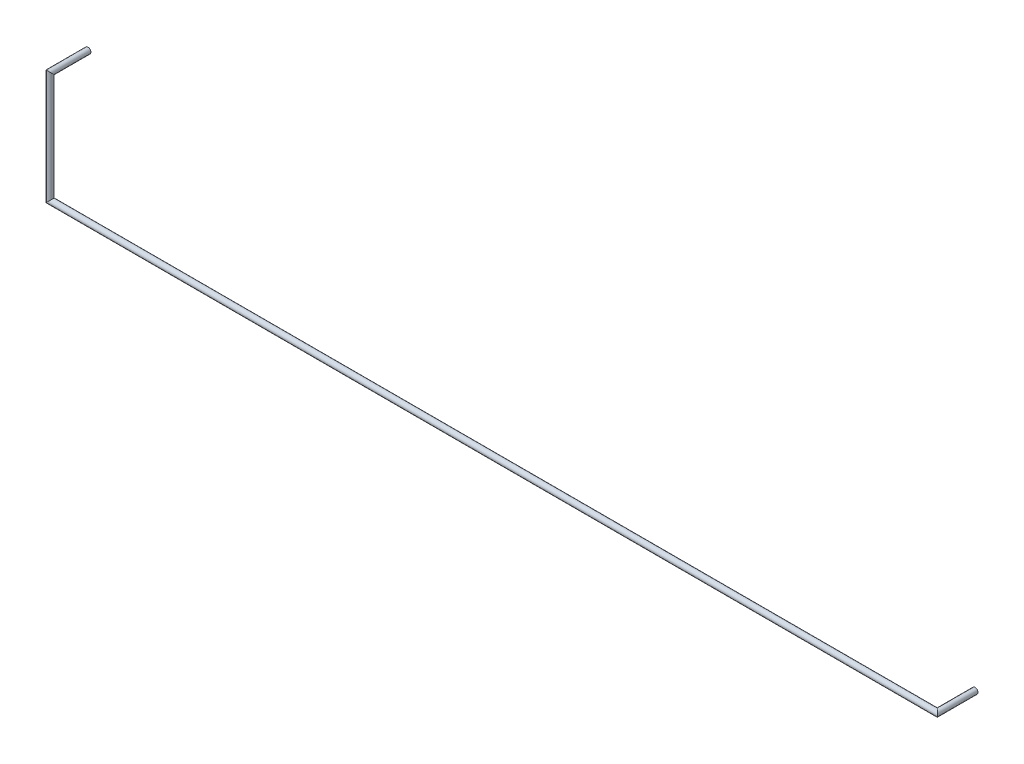
ISO-10303-21;
HEADER;
FILE_DESCRIPTION(('STEP AP214'),'2;1');
FILE_NAME('part.step','',(''),(''),'','','');
FILE_SCHEMA(('AUTOMOTIVE_DESIGN { 1 0 10303 214 1 1 1 1 }'));
ENDSEC;
DATA;
#1=APPLICATION_CONTEXT('core data for automotive mechanical design processes');
#2=APPLICATION_PROTOCOL_DEFINITION('international standard','automotive_design',2000,#1);
#3=PRODUCT_CONTEXT('',#1,'mechanical');
#4=PRODUCT('Part','Part','',(#3));
#5=PRODUCT_RELATED_PRODUCT_CATEGORY('part','',(#4));
#6=PRODUCT_DEFINITION_FORMATION('','',#4);
#7=PRODUCT_DEFINITION_CONTEXT('part definition',#1,'design');
#8=PRODUCT_DEFINITION('design','',#6,#7);
#9=PRODUCT_DEFINITION_SHAPE('','',#8);
#10=(LENGTH_UNIT() NAMED_UNIT(*) SI_UNIT(.MILLI.,.METRE.));
#11=(NAMED_UNIT(*) PLANE_ANGLE_UNIT() SI_UNIT($,.RADIAN.));
#12=(NAMED_UNIT(*) SI_UNIT($,.STERADIAN.) SOLID_ANGLE_UNIT());
#13=UNCERTAINTY_MEASURE_WITH_UNIT(LENGTH_MEASURE(1.E-05),#10,'distance_accuracy_value','');
#14=(GEOMETRIC_REPRESENTATION_CONTEXT(3) GLOBAL_UNCERTAINTY_ASSIGNED_CONTEXT((#13)) GLOBAL_UNIT_ASSIGNED_CONTEXT((#10,
#11,#12)) REPRESENTATION_CONTEXT('',''));
#15=CARTESIAN_POINT('',(0.,0.,0.));
#16=DIRECTION('',(0.,0.,1.));
#17=DIRECTION('',(1.,0.,0.));
#18=AXIS2_PLACEMENT_3D('',#15,#16,#17);
#19=CARTESIAN_POINT('',(60.96,-7.62,0.));
#20=DIRECTION('',(0.,0.,1.));
#21=DIRECTION('',(1.,0.,0.));
#22=AXIS2_PLACEMENT_3D('',#19,#20,#21);
#23=PLANE('',#22);
#24=CARTESIAN_POINT('',(60.96,-7.62,0.));
#25=DIRECTION('',(0.,0.,1.));
#26=DIRECTION('',(1.,0.,0.));
#27=AXIS2_PLACEMENT_3D('',#24,#25,#26);
#28=CIRCLE('',#27,0.199999999999999);
#29=CARTESIAN_POINT('',(61.16,-7.62,0.));
#30=VERTEX_POINT('',#29);
#31=EDGE_CURVE('E52',#30,#30,#28,.T.);
#32=ORIENTED_EDGE('',*,*,#31,.F.);
#33=EDGE_LOOP('',(#32));
#34=FACE_BOUND('',#33,.T.);
#35=ADVANCED_FACE('F49',(#34),#23,.F.);
#36=CARTESIAN_POINT('',(0.,0.,0.));
#37=DIRECTION('',(0.,0.,-1.));
#38=DIRECTION('',(0.,1.,0.));
#39=AXIS2_PLACEMENT_3D('',#36,#37,#38);
#40=PLANE('',#39);
#41=CARTESIAN_POINT('',(0.,0.,0.));
#42=DIRECTION('',(0.,0.,-1.));
#43=DIRECTION('',(0.,1.,0.));
#44=AXIS2_PLACEMENT_3D('',#41,#42,#43);
#45=CIRCLE('',#44,0.199999999999999);
#46=CARTESIAN_POINT('',(0.,0.199999999999999,0.));
#47=VERTEX_POINT('',#46);
#48=EDGE_CURVE('E57',#47,#47,#45,.T.);
#49=ORIENTED_EDGE('',*,*,#48,.T.);
#50=EDGE_LOOP('',(#49));
#51=FACE_BOUND('',#50,.T.);
#52=ADVANCED_FACE('F80',(#51),#40,.T.);
#53=CARTESIAN_POINT('',(60.96,-7.62,2.92));
#54=DIRECTION('',(0.,0.,-1.));
#55=DIRECTION('',(-1.,0.,0.));
#56=AXIS2_PLACEMENT_3D('',#53,#54,#55);
#57=CYLINDRICAL_SURFACE('',#56,0.199999999999999);
#58=CARTESIAN_POINT('',(60.96,-7.62,2.6));
#59=DIRECTION('',(0.707106781186548,0.,-0.707106781186548));
#60=DIRECTION('',(0.707106781186548,0.,0.707106781186548));
#61=AXIS2_PLACEMENT_3D('',#58,#59,#60);
#62=ELLIPSE('',#61,0.282842712474617,0.199999999999999);
#63=CARTESIAN_POINT('',(61.16,-7.62,2.8));
#64=VERTEX_POINT('',#63);
#65=EDGE_CURVE('E68',#64,#64,#62,.T.);
#66=ORIENTED_EDGE('',*,*,#65,.T.);
#67=EDGE_LOOP('',(#66));
#68=FACE_BOUND('',#67,.T.);
#69=ORIENTED_EDGE('',*,*,#31,.T.);
#70=EDGE_LOOP('',(#69));
#71=FACE_BOUND('',#70,.T.);
#72=ADVANCED_FACE('F77',(#68,#71),#57,.T.);
#73=CARTESIAN_POINT('',(-0.539999999999997,-7.62,2.6));
#74=DIRECTION('',(1.,0.,0.));
#75=DIRECTION('',(0.,0.,-1.));
#76=AXIS2_PLACEMENT_3D('',#73,#74,#75);
#77=CYLINDRICAL_SURFACE('',#76,0.199999999999999);
#78=CARTESIAN_POINT('',(0.,-7.62,2.6));
#79=DIRECTION('',(0.707106781186548,-0.707106781186548,0.));
#80=DIRECTION('',(-0.707106781186548,-0.707106781186548,0.));
#81=AXIS2_PLACEMENT_3D('',#78,#79,#80);
#82=ELLIPSE('',#81,0.282842712474617,0.199999999999999);
#83=CARTESIAN_POINT('',(-0.199999999999999,-7.82,2.6));
#84=VERTEX_POINT('',#83);
#85=EDGE_CURVE('E63',#84,#84,#82,.T.);
#86=ORIENTED_EDGE('',*,*,#85,.T.);
#87=EDGE_LOOP('',(#86));
#88=FACE_BOUND('',#87,.T.);
#89=ORIENTED_EDGE('',*,*,#65,.F.);
#90=EDGE_LOOP('',(#89));
#91=FACE_BOUND('',#90,.T.);
#92=ADVANCED_FACE('F93',(#88,#91),#77,.T.);
#93=CARTESIAN_POINT('',(0.,0.319999999999996,2.6));
#94=DIRECTION('',(0.,-1.,0.));
#95=DIRECTION('',(0.,0.,-1.));
#96=AXIS2_PLACEMENT_3D('',#93,#94,#95);
#97=CYLINDRICAL_SURFACE('',#96,0.199999999999999);
#98=CARTESIAN_POINT('',(0.,0.,2.6));
#99=DIRECTION('',(0.,-0.707106781186548,0.707106781186548));
#100=DIRECTION('',(0.,0.707106781186548,0.707106781186548));
#101=AXIS2_PLACEMENT_3D('',#98,#99,#100);
#102=ELLIPSE('',#101,0.282842712474617,0.199999999999999);
#103=CARTESIAN_POINT('',(0.,0.199999999999999,2.8));
#104=VERTEX_POINT('',#103);
#105=EDGE_CURVE('E11',#104,#104,#102,.T.);
#106=ORIENTED_EDGE('',*,*,#105,.T.);
#107=EDGE_LOOP('',(#106));
#108=FACE_BOUND('',#107,.T.);
#109=ORIENTED_EDGE('',*,*,#85,.F.);
#110=EDGE_LOOP('',(#109));
#111=FACE_BOUND('',#110,.T.);
#112=ADVANCED_FACE('F87',(#108,#111),#97,.T.);
#113=CARTESIAN_POINT('',(0.,0.,0.));
#114=DIRECTION('',(0.,0.,1.));
#115=DIRECTION('',(1.,0.,0.));
#116=AXIS2_PLACEMENT_3D('',#113,#114,#115);
#117=CYLINDRICAL_SURFACE('',#116,0.199999999999999);
#118=ORIENTED_EDGE('',*,*,#48,.F.);
#119=EDGE_LOOP('',(#118));
#120=FACE_BOUND('',#119,.T.);
#121=ORIENTED_EDGE('',*,*,#105,.F.);
#122=EDGE_LOOP('',(#121));
#123=FACE_BOUND('',#122,.T.);
#124=ADVANCED_FACE('F85',(#120,#123),#117,.T.);
#125=CLOSED_SHELL('',(#35,#52,#72,#92,#112,#124));
#126=MANIFOLD_SOLID_BREP('B2',#125);
#127=ADVANCED_BREP_SHAPE_REPRESENTATION('',(#18,#126),#14);
#128=SHAPE_DEFINITION_REPRESENTATION(#9,#127);
ENDSEC;
END-ISO-10303-21;
